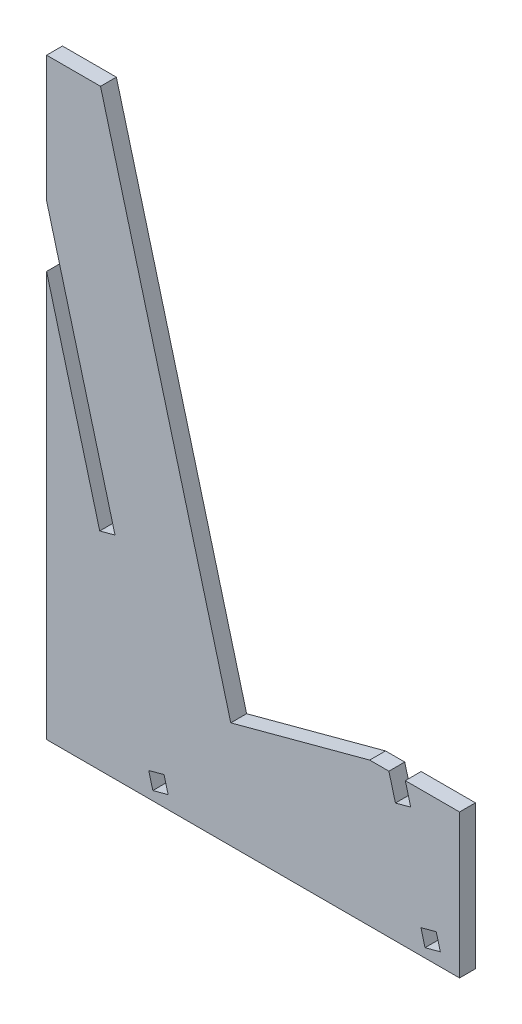
ISO-10303-21;
HEADER;
FILE_DESCRIPTION(('STEP AP214'),'2;1');
FILE_NAME('part.step','',(''),(''),'','','');
FILE_SCHEMA(('AUTOMOTIVE_DESIGN { 1 0 10303 214 1 1 1 1 }'));
ENDSEC;
DATA;
#1=APPLICATION_CONTEXT('core data for automotive mechanical design processes');
#2=APPLICATION_PROTOCOL_DEFINITION('international standard','automotive_design',2000,#1);
#3=PRODUCT_CONTEXT('',#1,'mechanical');
#4=PRODUCT('Part','Part','',(#3));
#5=PRODUCT_RELATED_PRODUCT_CATEGORY('part','',(#4));
#6=PRODUCT_DEFINITION_FORMATION('','',#4);
#7=PRODUCT_DEFINITION_CONTEXT('part definition',#1,'design');
#8=PRODUCT_DEFINITION('design','',#6,#7);
#9=PRODUCT_DEFINITION_SHAPE('','',#8);
#10=(LENGTH_UNIT() NAMED_UNIT(*) SI_UNIT(.MILLI.,.METRE.));
#11=(NAMED_UNIT(*) PLANE_ANGLE_UNIT() SI_UNIT($,.RADIAN.));
#12=(NAMED_UNIT(*) SI_UNIT($,.STERADIAN.) SOLID_ANGLE_UNIT());
#13=UNCERTAINTY_MEASURE_WITH_UNIT(LENGTH_MEASURE(1.E-05),#10,'distance_accuracy_value','');
#14=(GEOMETRIC_REPRESENTATION_CONTEXT(3) GLOBAL_UNCERTAINTY_ASSIGNED_CONTEXT((#13)) GLOBAL_UNIT_ASSIGNED_CONTEXT((#10,
#11,#12)) REPRESENTATION_CONTEXT('',''));
#15=CARTESIAN_POINT('',(0.,0.,0.));
#16=DIRECTION('',(0.,0.,1.));
#17=DIRECTION('',(1.,0.,0.));
#18=AXIS2_PLACEMENT_3D('',#15,#16,#17);
#19=CARTESIAN_POINT('',(34.9145041210964,4.30598395460493,2.8));
#20=DIRECTION('',(0.,-1.,0.));
#21=DIRECTION('',(1.,0.,0.));
#22=AXIS2_PLACEMENT_3D('',#19,#20,#21);
#23=PLANE('',#22);
#24=DIRECTION('',(-1.,0.,0.));
#25=VECTOR('',#24,1.);
#26=CARTESIAN_POINT('',(34.9145041210964,4.30598395460493,2.8));
#27=LINE('',#26,#25);
#28=CARTESIAN_POINT('',(22.4344378919087,4.30598395460493,2.8));
#29=VERTEX_POINT('',#28);
#30=CARTESIAN_POINT('',(19.0395041210964,4.30598395460493,2.8));
#31=VERTEX_POINT('',#30);
#32=EDGE_CURVE('E323',#29,#31,#27,.T.);
#33=ORIENTED_EDGE('',*,*,#32,.F.);
#34=DIRECTION('',(0.,0.,1.));
#35=VECTOR('',#34,1.);
#36=CARTESIAN_POINT('',(22.4344378919087,4.30598395460493,0.));
#37=LINE('',#36,#35);
#38=CARTESIAN_POINT('',(22.4344378919087,4.30598395460493,0.));
#39=VERTEX_POINT('',#38);
#40=EDGE_CURVE('E239',#39,#29,#37,.T.);
#41=ORIENTED_EDGE('',*,*,#40,.F.);
#42=DIRECTION('',(-1.,0.,0.));
#43=VECTOR('',#42,1.);
#44=CARTESIAN_POINT('',(34.9145041210964,4.30598395460493,0.));
#45=LINE('',#44,#43);
#46=CARTESIAN_POINT('',(19.0395041210964,4.30598395460493,0.));
#47=VERTEX_POINT('',#46);
#48=EDGE_CURVE('E342',#39,#47,#45,.T.);
#49=ORIENTED_EDGE('',*,*,#48,.T.);
#50=DIRECTION('',(0.,0.,-1.));
#51=VECTOR('',#50,1.);
#52=CARTESIAN_POINT('',(19.0395041210964,4.30598395460493,2.8));
#53=LINE('',#52,#51);
#54=EDGE_CURVE('E354',#31,#47,#53,.T.);
#55=ORIENTED_EDGE('',*,*,#54,.F.);
#56=EDGE_LOOP('',(#33,#41,#49,#55));
#57=FACE_BOUND('',#56,.T.);
#58=ADVANCED_FACE('F37',(#57),#23,.F.);
#59=CARTESIAN_POINT('',(-38.0290249762595,83.6027861660994,2.8));
#60=DIRECTION('',(1.,0.,0.));
#61=DIRECTION('',(0.,1.,0.));
#62=AXIS2_PLACEMENT_3D('',#59,#60,#61);
#63=PLANE('',#62);
#64=DIRECTION('',(0.,0.,1.));
#65=VECTOR('',#64,1.);
#66=CARTESIAN_POINT('',(-38.0290249762595,50.5231063605625,0.));
#67=LINE('',#66,#65);
#68=CARTESIAN_POINT('',(-38.0290249762595,50.5231063605625,0.));
#69=VERTEX_POINT('',#68);
#70=CARTESIAN_POINT('',(-38.0290249762595,50.5231063605625,2.8));
#71=VERTEX_POINT('',#70);
#72=EDGE_CURVE('E278',#69,#71,#67,.T.);
#73=ORIENTED_EDGE('',*,*,#72,.F.);
#74=DIRECTION('',(0.,-1.,0.));
#75=VECTOR('',#74,1.);
#76=CARTESIAN_POINT('',(-38.0290249762595,83.6027861660994,0.));
#77=LINE('',#76,#75);
#78=CARTESIAN_POINT('',(-38.0290249762595,-21.0940160453951,0.));
#79=VERTEX_POINT('',#78);
#80=EDGE_CURVE('E334',#69,#79,#77,.T.);
#81=ORIENTED_EDGE('',*,*,#80,.T.);
#82=DIRECTION('',(0.,0.,-1.));
#83=VECTOR('',#82,1.);
#84=CARTESIAN_POINT('',(-38.0290249762595,-21.0940160453951,2.8));
#85=LINE('',#84,#83);
#86=CARTESIAN_POINT('',(-38.0290249762595,-21.0940160453951,2.8));
#87=VERTEX_POINT('',#86);
#88=EDGE_CURVE('E45',#87,#79,#85,.T.);
#89=ORIENTED_EDGE('',*,*,#88,.F.);
#90=DIRECTION('',(0.,-1.,0.));
#91=VECTOR('',#90,1.);
#92=CARTESIAN_POINT('',(-38.0290249762595,83.6027861660994,2.8));
#93=LINE('',#92,#91);
#94=EDGE_CURVE('E314',#71,#87,#93,.T.);
#95=ORIENTED_EDGE('',*,*,#94,.F.);
#96=EDGE_LOOP('',(#73,#81,#89,#95));
#97=FACE_BOUND('',#96,.T.);
#98=ADVANCED_FACE('F393',(#97),#63,.F.);
#99=CARTESIAN_POINT('',(0.,0.,2.8));
#100=DIRECTION('',(0.,0.,1.));
#101=DIRECTION('',(1.,0.,0.));
#102=AXIS2_PLACEMENT_3D('',#99,#100,#101);
#103=PLANE('',#102);
#104=DIRECTION('',(0.258819045102516,-0.96592582628907,0.));
#105=VECTOR('',#104,1.);
#106=CARTESIAN_POINT('',(28.8149780366747,-19.5065160453951,2.8));
#107=LINE('',#106,#105);
#108=CARTESIAN_POINT('',(28.0902847103876,-16.8019237317857,2.8));
#109=VERTEX_POINT('',#108);
#110=CARTESIAN_POINT('',(28.8149780366747,-19.5065160453951,2.8));
#111=VERTEX_POINT('',#110);
#112=EDGE_CURVE('E52',#109,#111,#107,.T.);
#113=ORIENTED_EDGE('',*,*,#112,.F.);
#114=DIRECTION('',(-0.96592582628907,-0.258819045102515,0.));
#115=VECTOR('',#114,1.);
#116=CARTESIAN_POINT('',(28.0902847103876,-16.8019237317857,2.8));
#117=LINE('',#116,#115);
#118=CARTESIAN_POINT('',(30.794877023997,-16.0772304054986,2.8));
#119=VERTEX_POINT('',#118);
#120=EDGE_CURVE('E210',#119,#109,#117,.T.);
#121=ORIENTED_EDGE('',*,*,#120,.F.);
#122=DIRECTION('',(-0.258819045102517,0.965925826289069,0.));
#123=VECTOR('',#122,1.);
#124=CARTESIAN_POINT('',(31.5195703502841,-18.781822719108,2.8));
#125=LINE('',#124,#123);
#126=CARTESIAN_POINT('',(31.5195703502841,-18.781822719108,2.8));
#127=VERTEX_POINT('',#126);
#128=EDGE_CURVE('E213',#127,#119,#125,.T.);
#129=ORIENTED_EDGE('',*,*,#128,.F.);
#130=DIRECTION('',(0.96592582628907,0.258819045102515,0.));
#131=VECTOR('',#130,1.);
#132=CARTESIAN_POINT('',(28.8149780366747,-19.5065160453951,2.8));
#133=LINE('',#132,#131);
#134=EDGE_CURVE('E219',#111,#127,#133,.T.);
#135=ORIENTED_EDGE('',*,*,#134,.F.);
#136=EDGE_LOOP('',(#113,#121,#129,#135));
#137=FACE_BOUND('',#136,.T.);
#138=DIRECTION('',(0.258819045102515,-0.96592582628907,0.));
#139=VECTOR('',#138,1.);
#140=CARTESIAN_POINT('',(22.6286188834476,3.58129062831789,2.8));
#141=LINE('',#140,#139);
#142=CARTESIAN_POINT('',(23.5862493503269,0.00736507104833619,2.8));
#143=VERTEX_POINT('',#142);
#144=EDGE_CURVE('E241',#29,#143,#141,.T.);
#145=ORIENTED_EDGE('',*,*,#144,.F.);
#146=ORIENTED_EDGE('',*,*,#32,.T.);
#147=DIRECTION('',(-0.96592582628907,-0.258819045102515,0.));
#148=VECTOR('',#147,1.);
#149=CARTESIAN_POINT('',(19.0395041210964,4.30598395460493,2.8));
#150=LINE('',#149,#148);
#151=CARTESIAN_POINT('',(-5.49501186664597,-2.26801979099894,2.8));
#152=VERTEX_POINT('',#151);
#153=EDGE_CURVE('E327',#31,#152,#150,.T.);
#154=ORIENTED_EDGE('',*,*,#153,.T.);
#155=DIRECTION('',(-0.258819045102515,0.96592582628907,0.));
#156=VECTOR('',#155,1.);
#157=CARTESIAN_POINT('',(-5.49501186664597,-2.26801979099894,2.8));
#158=LINE('',#157,#156);
#159=CARTESIAN_POINT('',(-28.5040249762595,83.6027861660994,2.8));
#160=VERTEX_POINT('',#159);
#161=EDGE_CURVE('E329',#152,#160,#158,.T.);
#162=ORIENTED_EDGE('',*,*,#161,.T.);
#163=DIRECTION('',(-1.,0.,0.));
#164=VECTOR('',#163,1.);
#165=CARTESIAN_POINT('',(-28.5040249762595,83.6027861660994,2.8));
#166=LINE('',#165,#164);
#167=CARTESIAN_POINT('',(-38.0290249762595,83.6027861660994,2.8));
#168=VERTEX_POINT('',#167);
#169=EDGE_CURVE('E311',#160,#168,#166,.T.);
#170=ORIENTED_EDGE('',*,*,#169,.T.);
#171=CARTESIAN_POINT('',(-38.0290249762595,61.3414756150003,2.8));
#172=VERTEX_POINT('',#171);
#173=EDGE_CURVE('E316',#168,#172,#93,.T.);
#174=ORIENTED_EDGE('',*,*,#173,.T.);
#175=DIRECTION('',(-0.258819045102514,0.96592582628907,0.));
#176=VECTOR('',#175,1.);
#177=CARTESIAN_POINT('',(-20.146194439677,-5.39815653067168,2.8));
#178=LINE('',#177,#176);
#179=CARTESIAN_POINT('',(-25.942242277684,16.2329884838708,2.8));
#180=VERTEX_POINT('',#179);
#181=EDGE_CURVE('E265',#180,#172,#178,.T.);
#182=ORIENTED_EDGE('',*,*,#181,.F.);
#183=DIRECTION('',(0.965925826289069,0.258819045102517,0.));
#184=VECTOR('',#183,1.);
#185=CARTESIAN_POINT('',(-5.79604783800708,21.6311450145425,2.8));
#186=LINE('',#185,#184);
#187=CARTESIAN_POINT('',(-28.6468345912934,15.5082951575837,2.8));
#188=VERTEX_POINT('',#187);
#189=EDGE_CURVE('E259',#188,#180,#186,.T.);
#190=ORIENTED_EDGE('',*,*,#189,.F.);
#191=DIRECTION('',(-0.258819045102515,0.96592582628907,0.));
#192=VECTOR('',#191,1.);
#193=CARTESIAN_POINT('',(-22.8507867532864,-6.12284985695872,2.8));
#194=LINE('',#193,#192);
#195=EDGE_CURVE('E267',#188,#71,#194,.T.);
#196=ORIENTED_EDGE('',*,*,#195,.T.);
#197=ORIENTED_EDGE('',*,*,#94,.T.);
#198=DIRECTION('',(1.,0.,0.));
#199=VECTOR('',#198,1.);
#200=CARTESIAN_POINT('',(-38.0290249762595,-21.0940160453951,2.8));
#201=LINE('',#200,#199);
#202=CARTESIAN_POINT('',(34.9145041210964,-21.0940160453951,2.8));
#203=VERTEX_POINT('',#202);
#204=EDGE_CURVE('E319',#87,#203,#201,.T.);
#205=ORIENTED_EDGE('',*,*,#204,.T.);
#206=DIRECTION('',(0.,1.,0.));
#207=VECTOR('',#206,1.);
#208=CARTESIAN_POINT('',(34.9145041210964,-21.0940160453951,2.8));
#209=LINE('',#208,#207);
#210=CARTESIAN_POINT('',(34.9145041210964,4.30598395460493,2.8));
#211=VERTEX_POINT('',#210);
#212=EDGE_CURVE('E321',#203,#211,#209,.T.);
#213=ORIENTED_EDGE('',*,*,#212,.T.);
#214=CARTESIAN_POINT('',(25.333211197057,4.30598395460493,2.8));
#215=VERTEX_POINT('',#214);
#216=EDGE_CURVE('E324',#211,#215,#27,.T.);
#217=ORIENTED_EDGE('',*,*,#216,.T.);
#218=DIRECTION('',(-0.258819045102515,0.96592582628907,0.));
#219=VECTOR('',#218,1.);
#220=CARTESIAN_POINT('',(26.2908416639363,0.732058397335376,2.8));
#221=LINE('',#220,#219);
#222=CARTESIAN_POINT('',(26.2908416639363,0.732058397335376,2.8));
#223=VERTEX_POINT('',#222);
#224=EDGE_CURVE('E243',#223,#215,#221,.T.);
#225=ORIENTED_EDGE('',*,*,#224,.F.);
#226=DIRECTION('',(0.96592582628907,0.258819045102515,0.));
#227=VECTOR('',#226,1.);
#228=CARTESIAN_POINT('',(23.5862493503269,0.00736507104833619,2.8));
#229=LINE('',#228,#227);
#230=EDGE_CURVE('E220',#143,#223,#229,.T.);
#231=ORIENTED_EDGE('',*,*,#230,.F.);
#232=EDGE_LOOP('',(#145,#146,#154,#162,#170,#174,#182,#190,#196,#197,#205,#213,#217,#225,#231));
#233=FACE_BOUND('',#232,.T.);
#234=DIRECTION('',(-0.258819045102519,0.965925826289069,0.));
#235=VECTOR('',#234,1.);
#236=CARTESIAN_POINT('',(-22.8507867532864,-6.12284985695884,2.8));
#237=LINE('',#236,#235);
#238=CARTESIAN_POINT('',(-19.2646442063272,-19.5065160453951,2.8));
#239=VERTEX_POINT('',#238);
#240=CARTESIAN_POINT('',(-19.9893375326143,-16.8019237317857,2.8));
#241=VERTEX_POINT('',#240);
#242=EDGE_CURVE('E296',#239,#241,#237,.T.);
#243=ORIENTED_EDGE('',*,*,#242,.T.);
#244=DIRECTION('',(0.96592582628907,0.258819045102515,0.));
#245=VECTOR('',#244,1.);
#246=CARTESIAN_POINT('',(2.86144922067211,-10.6790738748269,2.8));
#247=LINE('',#246,#245);
#248=CARTESIAN_POINT('',(-17.2847452190049,-16.0772304054986,2.8));
#249=VERTEX_POINT('',#248);
#250=EDGE_CURVE('E226',#241,#249,#247,.T.);
#251=ORIENTED_EDGE('',*,*,#250,.T.);
#252=DIRECTION('',(-0.258819045102516,0.96592582628907,0.));
#253=VECTOR('',#252,1.);
#254=CARTESIAN_POINT('',(-20.146194439677,-5.39815653067171,2.8));
#255=LINE('',#254,#253);
#256=CARTESIAN_POINT('',(-16.5600518927178,-18.781822719108,2.8));
#257=VERTEX_POINT('',#256);
#258=EDGE_CURVE('E285',#257,#249,#255,.T.);
#259=ORIENTED_EDGE('',*,*,#258,.F.);
#260=DIRECTION('',(0.965925826289069,0.258819045102518,0.));
#261=VECTOR('',#260,1.);
#262=CARTESIAN_POINT('',(3.58614254695918,-13.3836661884363,2.8));
#263=LINE('',#262,#261);
#264=EDGE_CURVE('E299',#239,#257,#263,.T.);
#265=ORIENTED_EDGE('',*,*,#264,.F.);
#266=EDGE_LOOP('',(#243,#251,#259,#265));
#267=FACE_BOUND('',#266,.T.);
#268=ADVANCED_FACE('F387',(#137,#233,#267),#103,.T.);
#269=CARTESIAN_POINT('',(0.,0.,0.));
#270=DIRECTION('',(0.,0.,1.));
#271=DIRECTION('',(1.,0.,0.));
#272=AXIS2_PLACEMENT_3D('',#269,#270,#271);
#273=PLANE('',#272);
#274=DIRECTION('',(-0.96592582628907,-0.258819045102515,0.));
#275=VECTOR('',#274,1.);
#276=CARTESIAN_POINT('',(28.0902847103876,-16.8019237317857,0.));
#277=LINE('',#276,#275);
#278=CARTESIAN_POINT('',(30.794877023997,-16.0772304054986,0.));
#279=VERTEX_POINT('',#278);
#280=CARTESIAN_POINT('',(28.0902847103876,-16.8019237317857,0.));
#281=VERTEX_POINT('',#280);
#282=EDGE_CURVE('E200',#279,#281,#277,.T.);
#283=ORIENTED_EDGE('',*,*,#282,.T.);
#284=DIRECTION('',(0.258819045102516,-0.96592582628907,0.));
#285=VECTOR('',#284,1.);
#286=CARTESIAN_POINT('',(28.8149780366747,-19.5065160453951,0.));
#287=LINE('',#286,#285);
#288=CARTESIAN_POINT('',(28.8149780366747,-19.5065160453951,0.));
#289=VERTEX_POINT('',#288);
#290=EDGE_CURVE('E194',#281,#289,#287,.T.);
#291=ORIENTED_EDGE('',*,*,#290,.T.);
#292=DIRECTION('',(0.96592582628907,0.258819045102515,0.));
#293=VECTOR('',#292,1.);
#294=CARTESIAN_POINT('',(28.8149780366747,-19.5065160453951,0.));
#295=LINE('',#294,#293);
#296=CARTESIAN_POINT('',(31.5195703502841,-18.781822719108,0.));
#297=VERTEX_POINT('',#296);
#298=EDGE_CURVE('E203',#289,#297,#295,.T.);
#299=ORIENTED_EDGE('',*,*,#298,.T.);
#300=DIRECTION('',(-0.258819045102517,0.965925826289069,0.));
#301=VECTOR('',#300,1.);
#302=CARTESIAN_POINT('',(31.5195703502841,-18.781822719108,0.));
#303=LINE('',#302,#301);
#304=EDGE_CURVE('E60',#297,#279,#303,.T.);
#305=ORIENTED_EDGE('',*,*,#304,.T.);
#306=EDGE_LOOP('',(#283,#291,#299,#305));
#307=FACE_BOUND('',#306,.T.);
#308=ORIENTED_EDGE('',*,*,#48,.F.);
#309=DIRECTION('',(0.258819045102515,-0.96592582628907,0.));
#310=VECTOR('',#309,1.);
#311=CARTESIAN_POINT('',(23.5862493503269,0.00736507104833619,0.));
#312=LINE('',#311,#310);
#313=CARTESIAN_POINT('',(23.5862493503269,0.00736507104833619,0.));
#314=VERTEX_POINT('',#313);
#315=EDGE_CURVE('E244',#39,#314,#312,.T.);
#316=ORIENTED_EDGE('',*,*,#315,.T.);
#317=DIRECTION('',(0.96592582628907,0.258819045102515,0.));
#318=VECTOR('',#317,1.);
#319=CARTESIAN_POINT('',(23.5862493503269,0.00736507104833619,0.));
#320=LINE('',#319,#318);
#321=CARTESIAN_POINT('',(26.2908416639363,0.732058397335376,0.));
#322=VERTEX_POINT('',#321);
#323=EDGE_CURVE('E250',#314,#322,#320,.T.);
#324=ORIENTED_EDGE('',*,*,#323,.T.);
#325=DIRECTION('',(-0.258819045102515,0.96592582628907,0.));
#326=VECTOR('',#325,1.);
#327=CARTESIAN_POINT('',(26.2908416639363,0.732058397335376,0.));
#328=LINE('',#327,#326);
#329=CARTESIAN_POINT('',(25.333211197057,4.30598395460493,0.));
#330=VERTEX_POINT('',#329);
#331=EDGE_CURVE('E233',#322,#330,#328,.T.);
#332=ORIENTED_EDGE('',*,*,#331,.T.);
#333=CARTESIAN_POINT('',(34.9145041210964,4.30598395460493,0.));
#334=VERTEX_POINT('',#333);
#335=EDGE_CURVE('E343',#334,#330,#45,.T.);
#336=ORIENTED_EDGE('',*,*,#335,.F.);
#337=DIRECTION('',(0.,1.,0.));
#338=VECTOR('',#337,1.);
#339=CARTESIAN_POINT('',(34.9145041210964,-21.0940160453951,0.));
#340=LINE('',#339,#338);
#341=CARTESIAN_POINT('',(34.9145041210964,-21.0940160453951,0.));
#342=VERTEX_POINT('',#341);
#343=EDGE_CURVE('E340',#342,#334,#340,.T.);
#344=ORIENTED_EDGE('',*,*,#343,.F.);
#345=DIRECTION('',(1.,0.,0.));
#346=VECTOR('',#345,1.);
#347=CARTESIAN_POINT('',(-38.0290249762595,-21.0940160453951,0.));
#348=LINE('',#347,#346);
#349=EDGE_CURVE('E338',#79,#342,#348,.T.);
#350=ORIENTED_EDGE('',*,*,#349,.F.);
#351=ORIENTED_EDGE('',*,*,#80,.F.);
#352=DIRECTION('',(-0.258819045102515,0.96592582628907,0.));
#353=VECTOR('',#352,1.);
#354=CARTESIAN_POINT('',(-22.8507867532864,-6.12284985695872,0.));
#355=LINE('',#354,#353);
#356=CARTESIAN_POINT('',(-28.6468345912934,15.5082951575837,0.));
#357=VERTEX_POINT('',#356);
#358=EDGE_CURVE('E258',#357,#69,#355,.T.);
#359=ORIENTED_EDGE('',*,*,#358,.F.);
#360=DIRECTION('',(0.965925826289069,0.258819045102517,0.));
#361=VECTOR('',#360,1.);
#362=CARTESIAN_POINT('',(-5.79604783800708,21.6311450145425,0.));
#363=LINE('',#362,#361);
#364=CARTESIAN_POINT('',(-25.942242277684,16.2329884838708,0.));
#365=VERTEX_POINT('',#364);
#366=EDGE_CURVE('E261',#357,#365,#363,.T.);
#367=ORIENTED_EDGE('',*,*,#366,.T.);
#368=DIRECTION('',(-0.258819045102514,0.96592582628907,0.));
#369=VECTOR('',#368,1.);
#370=CARTESIAN_POINT('',(-20.146194439677,-5.39815653067168,0.));
#371=LINE('',#370,#369);
#372=CARTESIAN_POINT('',(-38.0290249762595,61.3414756150003,0.));
#373=VERTEX_POINT('',#372);
#374=EDGE_CURVE('E255',#365,#373,#371,.T.);
#375=ORIENTED_EDGE('',*,*,#374,.T.);
#376=CARTESIAN_POINT('',(-38.0290249762595,83.6027861660994,0.));
#377=VERTEX_POINT('',#376);
#378=EDGE_CURVE('E335',#377,#373,#77,.T.);
#379=ORIENTED_EDGE('',*,*,#378,.F.);
#380=DIRECTION('',(-1.,0.,0.));
#381=VECTOR('',#380,1.);
#382=CARTESIAN_POINT('',(-28.5040249762595,83.6027861660994,0.));
#383=LINE('',#382,#381);
#384=CARTESIAN_POINT('',(-28.5040249762595,83.6027861660994,0.));
#385=VERTEX_POINT('',#384);
#386=EDGE_CURVE('E275',#385,#377,#383,.T.);
#387=ORIENTED_EDGE('',*,*,#386,.F.);
#388=DIRECTION('',(-0.258819045102515,0.96592582628907,0.));
#389=VECTOR('',#388,1.);
#390=CARTESIAN_POINT('',(-5.49501186664597,-2.26801979099894,0.));
#391=LINE('',#390,#389);
#392=CARTESIAN_POINT('',(-5.49501186664597,-2.26801979099894,0.));
#393=VERTEX_POINT('',#392);
#394=EDGE_CURVE('E315',#393,#385,#391,.T.);
#395=ORIENTED_EDGE('',*,*,#394,.F.);
#396=DIRECTION('',(-0.96592582628907,-0.258819045102515,0.));
#397=VECTOR('',#396,1.);
#398=CARTESIAN_POINT('',(19.0395041210964,4.30598395460493,0.));
#399=LINE('',#398,#397);
#400=EDGE_CURVE('E346',#47,#393,#399,.T.);
#401=ORIENTED_EDGE('',*,*,#400,.F.);
#402=EDGE_LOOP('',(#308,#316,#324,#332,#336,#344,#350,#351,#359,#367,#375,#379,#387,#395,#401));
#403=FACE_BOUND('',#402,.T.);
#404=DIRECTION('',(0.96592582628907,0.258819045102515,0.));
#405=VECTOR('',#404,1.);
#406=CARTESIAN_POINT('',(2.86144922067211,-10.6790738748269,0.));
#407=LINE('',#406,#405);
#408=CARTESIAN_POINT('',(-19.9893375326143,-16.8019237317857,0.));
#409=VERTEX_POINT('',#408);
#410=CARTESIAN_POINT('',(-17.2847452190049,-16.0772304054986,0.));
#411=VERTEX_POINT('',#410);
#412=EDGE_CURVE('E282',#409,#411,#407,.T.);
#413=ORIENTED_EDGE('',*,*,#412,.F.);
#414=DIRECTION('',(-0.258819045102519,0.965925826289069,0.));
#415=VECTOR('',#414,1.);
#416=CARTESIAN_POINT('',(-22.8507867532864,-6.12284985695884,0.));
#417=LINE('',#416,#415);
#418=CARTESIAN_POINT('',(-19.2646442063272,-19.5065160453951,0.));
#419=VERTEX_POINT('',#418);
#420=EDGE_CURVE('E284',#419,#409,#417,.T.);
#421=ORIENTED_EDGE('',*,*,#420,.F.);
#422=DIRECTION('',(0.965925826289069,0.258819045102518,0.));
#423=VECTOR('',#422,1.);
#424=CARTESIAN_POINT('',(3.58614254695918,-13.3836661884363,0.));
#425=LINE('',#424,#423);
#426=CARTESIAN_POINT('',(-16.5600518927178,-18.781822719108,0.));
#427=VERTEX_POINT('',#426);
#428=EDGE_CURVE('E287',#419,#427,#425,.T.);
#429=ORIENTED_EDGE('',*,*,#428,.T.);
#430=DIRECTION('',(-0.258819045102516,0.96592582628907,0.));
#431=VECTOR('',#430,1.);
#432=CARTESIAN_POINT('',(-20.146194439677,-5.39815653067171,0.));
#433=LINE('',#432,#431);
#434=EDGE_CURVE('E290',#427,#411,#433,.T.);
#435=ORIENTED_EDGE('',*,*,#434,.T.);
#436=EDGE_LOOP('',(#413,#421,#429,#435));
#437=FACE_BOUND('',#436,.T.);
#438=ADVANCED_FACE('F207',(#307,#403,#437),#273,.F.);
#439=CARTESIAN_POINT('',(-28.5040249762595,83.6027861660994,2.8));
#440=DIRECTION('',(0.,-1.,0.));
#441=DIRECTION('',(1.,0.,0.));
#442=AXIS2_PLACEMENT_3D('',#439,#440,#441);
#443=PLANE('',#442);
#444=ORIENTED_EDGE('',*,*,#386,.T.);
#445=DIRECTION('',(0.,0.,-1.));
#446=VECTOR('',#445,1.);
#447=CARTESIAN_POINT('',(-38.0290249762595,83.6027861660994,2.8));
#448=LINE('',#447,#446);
#449=EDGE_CURVE('E11',#168,#377,#448,.T.);
#450=ORIENTED_EDGE('',*,*,#449,.F.);
#451=ORIENTED_EDGE('',*,*,#169,.F.);
#452=DIRECTION('',(0.,0.,-1.));
#453=VECTOR('',#452,1.);
#454=CARTESIAN_POINT('',(-28.5040249762595,83.6027861660994,2.8));
#455=LINE('',#454,#453);
#456=EDGE_CURVE('E331',#160,#385,#455,.T.);
#457=ORIENTED_EDGE('',*,*,#456,.T.);
#458=EDGE_LOOP('',(#444,#450,#451,#457));
#459=FACE_BOUND('',#458,.T.);
#460=ADVANCED_FACE('F39',(#459),#443,.F.);
#461=ORIENTED_EDGE('',*,*,#378,.T.);
#462=DIRECTION('',(0.,0.,1.));
#463=VECTOR('',#462,1.);
#464=CARTESIAN_POINT('',(-38.0290249762595,61.3414756150003,0.));
#465=LINE('',#464,#463);
#466=EDGE_CURVE('E264',#373,#172,#465,.T.);
#467=ORIENTED_EDGE('',*,*,#466,.T.);
#468=ORIENTED_EDGE('',*,*,#173,.F.);
#469=ORIENTED_EDGE('',*,*,#449,.T.);
#470=EDGE_LOOP('',(#461,#467,#468,#469));
#471=FACE_BOUND('',#470,.T.);
#472=ADVANCED_FACE('F404',(#471),#63,.F.);
#473=CARTESIAN_POINT('',(-38.0290249762595,-21.0940160453951,2.8));
#474=DIRECTION('',(0.,1.,0.));
#475=DIRECTION('',(-1.,0.,0.));
#476=AXIS2_PLACEMENT_3D('',#473,#474,#475);
#477=PLANE('',#476);
#478=ORIENTED_EDGE('',*,*,#349,.T.);
#479=DIRECTION('',(0.,0.,-1.));
#480=VECTOR('',#479,1.);
#481=CARTESIAN_POINT('',(34.9145041210964,-21.0940160453951,2.8));
#482=LINE('',#481,#480);
#483=EDGE_CURVE('E360',#203,#342,#482,.T.);
#484=ORIENTED_EDGE('',*,*,#483,.F.);
#485=ORIENTED_EDGE('',*,*,#204,.F.);
#486=ORIENTED_EDGE('',*,*,#88,.T.);
#487=EDGE_LOOP('',(#478,#484,#485,#486));
#488=FACE_BOUND('',#487,.T.);
#489=ADVANCED_FACE('F367',(#488),#477,.F.);
#490=CARTESIAN_POINT('',(34.9145041210964,-21.0940160453951,2.8));
#491=DIRECTION('',(-1.,0.,0.));
#492=DIRECTION('',(0.,-1.,0.));
#493=AXIS2_PLACEMENT_3D('',#490,#491,#492);
#494=PLANE('',#493);
#495=ORIENTED_EDGE('',*,*,#343,.T.);
#496=DIRECTION('',(0.,0.,-1.));
#497=VECTOR('',#496,1.);
#498=CARTESIAN_POINT('',(34.9145041210964,4.30598395460493,2.8));
#499=LINE('',#498,#497);
#500=EDGE_CURVE('E357',#211,#334,#499,.T.);
#501=ORIENTED_EDGE('',*,*,#500,.F.);
#502=ORIENTED_EDGE('',*,*,#212,.F.);
#503=ORIENTED_EDGE('',*,*,#483,.T.);
#504=EDGE_LOOP('',(#495,#501,#502,#503));
#505=FACE_BOUND('',#504,.T.);
#506=ADVANCED_FACE('F379',(#505),#494,.F.);
#507=ORIENTED_EDGE('',*,*,#335,.T.);
#508=DIRECTION('',(0.,0.,1.));
#509=VECTOR('',#508,1.);
#510=CARTESIAN_POINT('',(25.333211197057,4.30598395460493,0.));
#511=LINE('',#510,#509);
#512=EDGE_CURVE('E236',#330,#215,#511,.T.);
#513=ORIENTED_EDGE('',*,*,#512,.T.);
#514=ORIENTED_EDGE('',*,*,#216,.F.);
#515=ORIENTED_EDGE('',*,*,#500,.T.);
#516=EDGE_LOOP('',(#507,#513,#514,#515));
#517=FACE_BOUND('',#516,.T.);
#518=ADVANCED_FACE('F383',(#517),#23,.F.);
#519=CARTESIAN_POINT('',(19.0395041210964,4.30598395460493,2.8));
#520=DIRECTION('',(0.258819045102515,-0.96592582628907,0.));
#521=DIRECTION('',(0.96592582628907,0.258819045102515,0.));
#522=AXIS2_PLACEMENT_3D('',#519,#520,#521);
#523=PLANE('',#522);
#524=ORIENTED_EDGE('',*,*,#400,.T.);
#525=DIRECTION('',(0.,0.,-1.));
#526=VECTOR('',#525,1.);
#527=CARTESIAN_POINT('',(-5.49501186664597,-2.26801979099894,2.8));
#528=LINE('',#527,#526);
#529=EDGE_CURVE('E351',#152,#393,#528,.T.);
#530=ORIENTED_EDGE('',*,*,#529,.F.);
#531=ORIENTED_EDGE('',*,*,#153,.F.);
#532=ORIENTED_EDGE('',*,*,#54,.T.);
#533=EDGE_LOOP('',(#524,#530,#531,#532));
#534=FACE_BOUND('',#533,.T.);
#535=ADVANCED_FACE('F418',(#534),#523,.F.);
#536=CARTESIAN_POINT('',(-5.49501186664597,-2.26801979099894,2.8));
#537=DIRECTION('',(-0.96592582628907,-0.258819045102515,0.));
#538=DIRECTION('',(0.258819045102515,-0.96592582628907,0.));
#539=AXIS2_PLACEMENT_3D('',#536,#537,#538);
#540=PLANE('',#539);
#541=ORIENTED_EDGE('',*,*,#394,.T.);
#542=ORIENTED_EDGE('',*,*,#456,.F.);
#543=ORIENTED_EDGE('',*,*,#161,.F.);
#544=ORIENTED_EDGE('',*,*,#529,.T.);
#545=EDGE_LOOP('',(#541,#542,#543,#544));
#546=FACE_BOUND('',#545,.T.);
#547=ADVANCED_FACE('F414',(#546),#540,.F.);
#548=CARTESIAN_POINT('',(2.86144922067211,-10.6790738748269,0.));
#549=DIRECTION('',(0.258819045102515,-0.96592582628907,0.));
#550=DIRECTION('',(0.96592582628907,0.258819045102515,0.));
#551=AXIS2_PLACEMENT_3D('',#548,#549,#550);
#552=PLANE('',#551);
#553=ORIENTED_EDGE('',*,*,#250,.F.);
#554=DIRECTION('',(0.,0.,1.));
#555=VECTOR('',#554,1.);
#556=CARTESIAN_POINT('',(-19.9893375326143,-16.8019237317857,0.));
#557=LINE('',#556,#555);
#558=EDGE_CURVE('E293',#409,#241,#557,.T.);
#559=ORIENTED_EDGE('',*,*,#558,.F.);
#560=ORIENTED_EDGE('',*,*,#412,.T.);
#561=DIRECTION('',(0.,0.,1.));
#562=VECTOR('',#561,1.);
#563=CARTESIAN_POINT('',(-17.2847452190049,-16.0772304054986,0.));
#564=LINE('',#563,#562);
#565=EDGE_CURVE('E268',#411,#249,#564,.T.);
#566=ORIENTED_EDGE('',*,*,#565,.T.);
#567=EDGE_LOOP('',(#553,#559,#560,#566));
#568=FACE_BOUND('',#567,.T.);
#569=ADVANCED_FACE('F471',(#568),#552,.T.);
#570=CARTESIAN_POINT('',(-20.146194439677,-5.39815653067171,0.));
#571=DIRECTION('',(0.96592582628907,0.258819045102516,0.));
#572=DIRECTION('',(-0.258819045102516,0.96592582628907,0.));
#573=AXIS2_PLACEMENT_3D('',#570,#571,#572);
#574=PLANE('',#573);
#575=ORIENTED_EDGE('',*,*,#258,.T.);
#576=ORIENTED_EDGE('',*,*,#565,.F.);
#577=ORIENTED_EDGE('',*,*,#434,.F.);
#578=DIRECTION('',(0.,0.,1.));
#579=VECTOR('',#578,1.);
#580=CARTESIAN_POINT('',(-16.5600518927178,-18.781822719108,0.));
#581=LINE('',#580,#579);
#582=EDGE_CURVE('E305',#427,#257,#581,.T.);
#583=ORIENTED_EDGE('',*,*,#582,.T.);
#584=EDGE_LOOP('',(#575,#576,#577,#583));
#585=FACE_BOUND('',#584,.T.);
#586=ADVANCED_FACE('F475',(#585),#574,.F.);
#587=CARTESIAN_POINT('',(3.58614254695918,-13.3836661884363,0.));
#588=DIRECTION('',(0.258819045102518,-0.965925826289069,0.));
#589=DIRECTION('',(0.965925826289069,0.258819045102518,0.));
#590=AXIS2_PLACEMENT_3D('',#587,#588,#589);
#591=PLANE('',#590);
#592=ORIENTED_EDGE('',*,*,#264,.T.);
#593=ORIENTED_EDGE('',*,*,#582,.F.);
#594=ORIENTED_EDGE('',*,*,#428,.F.);
#595=DIRECTION('',(0.,0.,1.));
#596=VECTOR('',#595,1.);
#597=CARTESIAN_POINT('',(-19.2646442063272,-19.5065160453951,0.));
#598=LINE('',#597,#596);
#599=EDGE_CURVE('E307',#419,#239,#598,.T.);
#600=ORIENTED_EDGE('',*,*,#599,.T.);
#601=EDGE_LOOP('',(#592,#593,#594,#600));
#602=FACE_BOUND('',#601,.T.);
#603=ADVANCED_FACE('F480',(#602),#591,.F.);
#604=CARTESIAN_POINT('',(-22.8507867532864,-6.12284985695884,0.));
#605=DIRECTION('',(0.965925826289069,0.258819045102519,0.));
#606=DIRECTION('',(-0.258819045102519,0.965925826289069,0.));
#607=AXIS2_PLACEMENT_3D('',#604,#605,#606);
#608=PLANE('',#607);
#609=ORIENTED_EDGE('',*,*,#242,.F.);
#610=ORIENTED_EDGE('',*,*,#599,.F.);
#611=ORIENTED_EDGE('',*,*,#420,.T.);
#612=ORIENTED_EDGE('',*,*,#558,.T.);
#613=EDGE_LOOP('',(#609,#610,#611,#612));
#614=FACE_BOUND('',#613,.T.);
#615=ADVANCED_FACE('F484',(#614),#608,.T.);
#616=CARTESIAN_POINT('',(-20.146194439677,-5.39815653067168,0.));
#617=DIRECTION('',(0.96592582628907,0.258819045102514,0.));
#618=DIRECTION('',(-0.258819045102514,0.96592582628907,0.));
#619=AXIS2_PLACEMENT_3D('',#616,#617,#618);
#620=PLANE('',#619);
#621=ORIENTED_EDGE('',*,*,#181,.T.);
#622=ORIENTED_EDGE('',*,*,#466,.F.);
#623=ORIENTED_EDGE('',*,*,#374,.F.);
#624=DIRECTION('',(0.,0.,1.));
#625=VECTOR('',#624,1.);
#626=CARTESIAN_POINT('',(-25.942242277684,16.2329884838708,0.));
#627=LINE('',#626,#625);
#628=EDGE_CURVE('E273',#365,#180,#627,.T.);
#629=ORIENTED_EDGE('',*,*,#628,.T.);
#630=EDGE_LOOP('',(#621,#622,#623,#629));
#631=FACE_BOUND('',#630,.T.);
#632=ADVANCED_FACE('F402',(#631),#620,.F.);
#633=CARTESIAN_POINT('',(-5.79604783800708,21.6311450145425,0.));
#634=DIRECTION('',(0.258819045102517,-0.965925826289069,0.));
#635=DIRECTION('',(0.965925826289069,0.258819045102517,0.));
#636=AXIS2_PLACEMENT_3D('',#633,#634,#635);
#637=PLANE('',#636);
#638=ORIENTED_EDGE('',*,*,#189,.T.);
#639=ORIENTED_EDGE('',*,*,#628,.F.);
#640=ORIENTED_EDGE('',*,*,#366,.F.);
#641=DIRECTION('',(0.,0.,1.));
#642=VECTOR('',#641,1.);
#643=CARTESIAN_POINT('',(-28.6468345912934,15.5082951575837,0.));
#644=LINE('',#643,#642);
#645=EDGE_CURVE('E276',#357,#188,#644,.T.);
#646=ORIENTED_EDGE('',*,*,#645,.T.);
#647=EDGE_LOOP('',(#638,#639,#640,#646));
#648=FACE_BOUND('',#647,.T.);
#649=ADVANCED_FACE('F399',(#648),#637,.F.);
#650=CARTESIAN_POINT('',(-22.8507867532864,-6.12284985695872,0.));
#651=DIRECTION('',(0.96592582628907,0.258819045102515,0.));
#652=DIRECTION('',(-0.258819045102515,0.96592582628907,0.));
#653=AXIS2_PLACEMENT_3D('',#650,#651,#652);
#654=PLANE('',#653);
#655=ORIENTED_EDGE('',*,*,#195,.F.);
#656=ORIENTED_EDGE('',*,*,#645,.F.);
#657=ORIENTED_EDGE('',*,*,#358,.T.);
#658=ORIENTED_EDGE('',*,*,#72,.T.);
#659=EDGE_LOOP('',(#655,#656,#657,#658));
#660=FACE_BOUND('',#659,.T.);
#661=ADVANCED_FACE('F395',(#660),#654,.T.);
#662=CARTESIAN_POINT('',(22.6286188834476,3.58129062831789,0.));
#663=DIRECTION('',(-0.96592582628907,-0.258819045102515,0.));
#664=DIRECTION('',(0.258819045102515,-0.96592582628907,0.));
#665=AXIS2_PLACEMENT_3D('',#662,#663,#664);
#666=PLANE('',#665);
#667=ORIENTED_EDGE('',*,*,#144,.T.);
#668=DIRECTION('',(0.,0.,1.));
#669=VECTOR('',#668,1.);
#670=CARTESIAN_POINT('',(23.5862493503269,0.00736507104833619,0.));
#671=LINE('',#670,#669);
#672=EDGE_CURVE('E230',#314,#143,#671,.T.);
#673=ORIENTED_EDGE('',*,*,#672,.F.);
#674=ORIENTED_EDGE('',*,*,#315,.F.);
#675=ORIENTED_EDGE('',*,*,#40,.T.);
#676=EDGE_LOOP('',(#667,#673,#674,#675));
#677=FACE_BOUND('',#676,.T.);
#678=ADVANCED_FACE('F425',(#677),#666,.F.);
#679=CARTESIAN_POINT('',(26.2908416639363,0.732058397335376,0.));
#680=DIRECTION('',(0.96592582628907,0.258819045102515,0.));
#681=DIRECTION('',(-0.258819045102515,0.96592582628907,0.));
#682=AXIS2_PLACEMENT_3D('',#679,#680,#681);
#683=PLANE('',#682);
#684=ORIENTED_EDGE('',*,*,#224,.T.);
#685=ORIENTED_EDGE('',*,*,#512,.F.);
#686=ORIENTED_EDGE('',*,*,#331,.F.);
#687=DIRECTION('',(0.,0.,1.));
#688=VECTOR('',#687,1.);
#689=CARTESIAN_POINT('',(26.2908416639363,0.732058397335376,0.));
#690=LINE('',#689,#688);
#691=EDGE_CURVE('E234',#322,#223,#690,.T.);
#692=ORIENTED_EDGE('',*,*,#691,.T.);
#693=EDGE_LOOP('',(#684,#685,#686,#692));
#694=FACE_BOUND('',#693,.T.);
#695=ADVANCED_FACE('F430',(#694),#683,.F.);
#696=CARTESIAN_POINT('',(23.5862493503269,0.00736507104833619,0.));
#697=DIRECTION('',(0.258819045102515,-0.96592582628907,0.));
#698=DIRECTION('',(0.96592582628907,0.258819045102515,0.));
#699=AXIS2_PLACEMENT_3D('',#696,#697,#698);
#700=PLANE('',#699);
#701=ORIENTED_EDGE('',*,*,#230,.T.);
#702=ORIENTED_EDGE('',*,*,#691,.F.);
#703=ORIENTED_EDGE('',*,*,#323,.F.);
#704=ORIENTED_EDGE('',*,*,#672,.T.);
#705=EDGE_LOOP('',(#701,#702,#703,#704));
#706=FACE_BOUND('',#705,.T.);
#707=ADVANCED_FACE('F427',(#706),#700,.F.);
#708=CARTESIAN_POINT('',(28.8149780366747,-19.5065160453951,0.));
#709=DIRECTION('',(-0.96592582628907,-0.258819045102516,0.));
#710=DIRECTION('',(0.258819045102516,-0.96592582628907,0.));
#711=AXIS2_PLACEMENT_3D('',#708,#709,#710);
#712=PLANE('',#711);
#713=ORIENTED_EDGE('',*,*,#112,.T.);
#714=DIRECTION('',(0.,0.,1.));
#715=VECTOR('',#714,1.);
#716=CARTESIAN_POINT('',(28.8149780366747,-19.5065160453951,0.));
#717=LINE('',#716,#715);
#718=EDGE_CURVE('E190',#289,#111,#717,.T.);
#719=ORIENTED_EDGE('',*,*,#718,.F.);
#720=ORIENTED_EDGE('',*,*,#290,.F.);
#721=DIRECTION('',(0.,0.,1.));
#722=VECTOR('',#721,1.);
#723=CARTESIAN_POINT('',(28.0902847103876,-16.8019237317857,0.));
#724=LINE('',#723,#722);
#725=EDGE_CURVE('E224',#281,#109,#724,.T.);
#726=ORIENTED_EDGE('',*,*,#725,.T.);
#727=EDGE_LOOP('',(#713,#719,#720,#726));
#728=FACE_BOUND('',#727,.T.);
#729=ADVANCED_FACE('F192',(#728),#712,.F.);
#730=CARTESIAN_POINT('',(28.0902847103876,-16.8019237317857,0.));
#731=DIRECTION('',(-0.258819045102515,0.96592582628907,0.));
#732=DIRECTION('',(-0.96592582628907,-0.258819045102515,0.));
#733=AXIS2_PLACEMENT_3D('',#730,#731,#732);
#734=PLANE('',#733);
#735=ORIENTED_EDGE('',*,*,#120,.T.);
#736=ORIENTED_EDGE('',*,*,#725,.F.);
#737=ORIENTED_EDGE('',*,*,#282,.F.);
#738=DIRECTION('',(0.,0.,1.));
#739=VECTOR('',#738,1.);
#740=CARTESIAN_POINT('',(30.794877023997,-16.0772304054986,0.));
#741=LINE('',#740,#739);
#742=EDGE_CURVE('E227',#279,#119,#741,.T.);
#743=ORIENTED_EDGE('',*,*,#742,.T.);
#744=EDGE_LOOP('',(#735,#736,#737,#743));
#745=FACE_BOUND('',#744,.T.);
#746=ADVANCED_FACE('F532',(#745),#734,.F.);
#747=CARTESIAN_POINT('',(31.5195703502841,-18.781822719108,0.));
#748=DIRECTION('',(0.965925826289069,0.258819045102517,0.));
#749=DIRECTION('',(-0.258819045102517,0.965925826289069,0.));
#750=AXIS2_PLACEMENT_3D('',#747,#748,#749);
#751=PLANE('',#750);
#752=ORIENTED_EDGE('',*,*,#128,.T.);
#753=ORIENTED_EDGE('',*,*,#742,.F.);
#754=ORIENTED_EDGE('',*,*,#304,.F.);
#755=DIRECTION('',(0.,0.,1.));
#756=VECTOR('',#755,1.);
#757=CARTESIAN_POINT('',(31.5195703502841,-18.781822719108,0.));
#758=LINE('',#757,#756);
#759=EDGE_CURVE('E199',#297,#127,#758,.T.);
#760=ORIENTED_EDGE('',*,*,#759,.T.);
#761=EDGE_LOOP('',(#752,#753,#754,#760));
#762=FACE_BOUND('',#761,.T.);
#763=ADVANCED_FACE('F542',(#762),#751,.F.);
#764=CARTESIAN_POINT('',(28.8149780366747,-19.5065160453951,0.));
#765=DIRECTION('',(0.258819045102515,-0.96592582628907,0.));
#766=DIRECTION('',(0.96592582628907,0.258819045102515,0.));
#767=AXIS2_PLACEMENT_3D('',#764,#765,#766);
#768=PLANE('',#767);
#769=ORIENTED_EDGE('',*,*,#134,.T.);
#770=ORIENTED_EDGE('',*,*,#759,.F.);
#771=ORIENTED_EDGE('',*,*,#298,.F.);
#772=ORIENTED_EDGE('',*,*,#718,.T.);
#773=EDGE_LOOP('',(#769,#770,#771,#772));
#774=FACE_BOUND('',#773,.T.);
#775=ADVANCED_FACE('F204',(#774),#768,.F.);
#776=CLOSED_SHELL('',(#58,#98,#268,#438,#460,#472,#489,#506,#518,#535,#547,#569,#586,#603,#615,
#632,#649,#661,#678,#695,#707,#729,#746,#763,#775));
#777=MANIFOLD_SOLID_BREP('B2',#776);
#778=ADVANCED_BREP_SHAPE_REPRESENTATION('',(#18,#777),#14);
#779=SHAPE_DEFINITION_REPRESENTATION(#9,#778);
ENDSEC;
END-ISO-10303-21;
